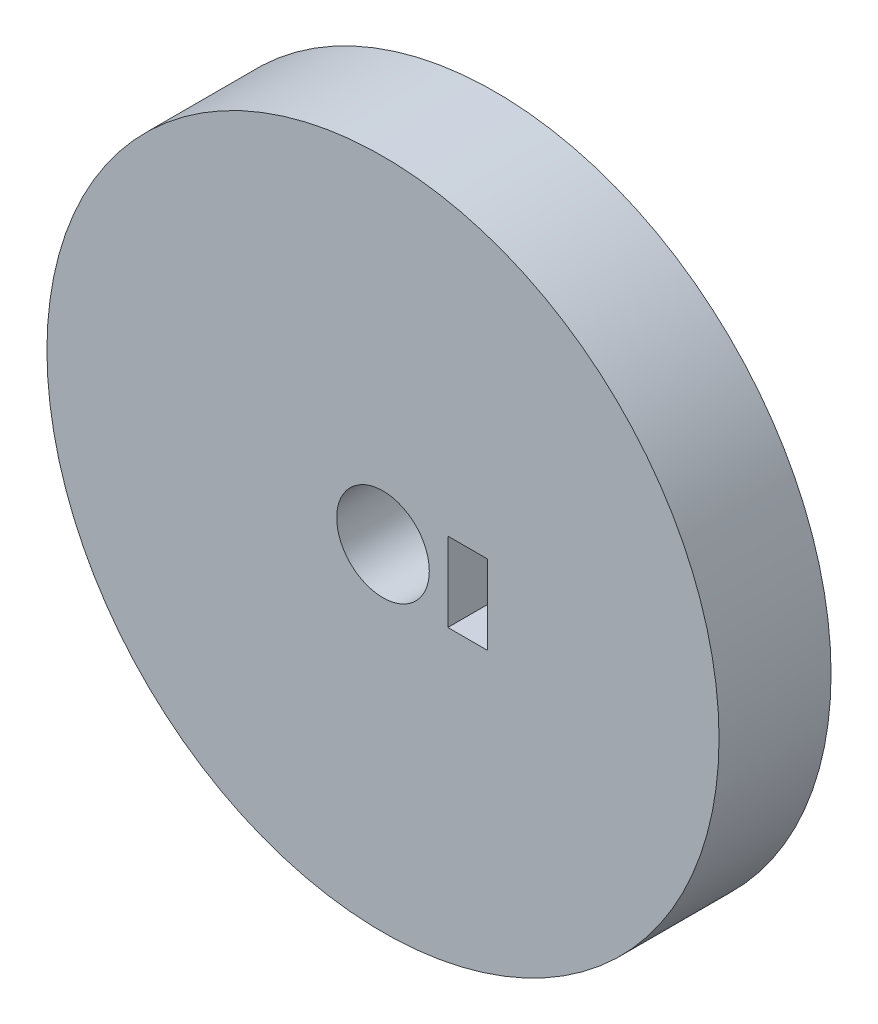
ISO-10303-21;
HEADER;
FILE_DESCRIPTION(('STEP AP214'),'2;1');
FILE_NAME('part.step','',(''),(''),'','','');
FILE_SCHEMA(('AUTOMOTIVE_DESIGN { 1 0 10303 214 1 1 1 1 }'));
ENDSEC;
DATA;
#1=APPLICATION_CONTEXT('core data for automotive mechanical design processes');
#2=APPLICATION_PROTOCOL_DEFINITION('international standard','automotive_design',2000,#1);
#3=PRODUCT_CONTEXT('',#1,'mechanical');
#4=PRODUCT('Part','Part','',(#3));
#5=PRODUCT_RELATED_PRODUCT_CATEGORY('part','',(#4));
#6=PRODUCT_DEFINITION_FORMATION('','',#4);
#7=PRODUCT_DEFINITION_CONTEXT('part definition',#1,'design');
#8=PRODUCT_DEFINITION('design','',#6,#7);
#9=PRODUCT_DEFINITION_SHAPE('','',#8);
#10=(LENGTH_UNIT() NAMED_UNIT(*) SI_UNIT(.MILLI.,.METRE.));
#11=(NAMED_UNIT(*) PLANE_ANGLE_UNIT() SI_UNIT($,.RADIAN.));
#12=(NAMED_UNIT(*) SI_UNIT($,.STERADIAN.) SOLID_ANGLE_UNIT());
#13=UNCERTAINTY_MEASURE_WITH_UNIT(LENGTH_MEASURE(1.E-05),#10,'distance_accuracy_value','');
#14=(GEOMETRIC_REPRESENTATION_CONTEXT(3) GLOBAL_UNCERTAINTY_ASSIGNED_CONTEXT((#13)) GLOBAL_UNIT_ASSIGNED_CONTEXT((#10,
#11,#12)) REPRESENTATION_CONTEXT('',''));
#15=CARTESIAN_POINT('',(0.,0.,0.));
#16=DIRECTION('',(0.,0.,1.));
#17=DIRECTION('',(1.,0.,0.));
#18=AXIS2_PLACEMENT_3D('',#15,#16,#17);
#19=CARTESIAN_POINT('',(0.,-7.07220049371049,15.));
#20=DIRECTION('',(0.,-1.,0.));
#21=DIRECTION('',(0.,0.,-1.));
#22=AXIS2_PLACEMENT_3D('',#19,#20,#21);
#23=PLANE('',#22);
#24=DIRECTION('',(-1.,0.,0.));
#25=VECTOR('',#24,1.);
#26=CARTESIAN_POINT('',(0.,-7.07220049371049,0.));
#27=LINE('',#26,#25);
#28=CARTESIAN_POINT('',(-71.3345035865023,-7.07220049371048,0.));
#29=VERTEX_POINT('',#28);
#30=CARTESIAN_POINT('',(-76.6345035865023,-7.07220049371049,0.));
#31=VERTEX_POINT('',#30);
#32=EDGE_CURVE('E111',#29,#31,#27,.T.);
#33=ORIENTED_EDGE('',*,*,#32,.F.);
#34=DIRECTION('',(0.,0.,-1.));
#35=VECTOR('',#34,1.);
#36=CARTESIAN_POINT('',(-71.3345035865023,-7.07220049371048,15.));
#37=LINE('',#36,#35);
#38=CARTESIAN_POINT('',(-71.3345035865023,-7.07220049371048,15.));
#39=VERTEX_POINT('',#38);
#40=EDGE_CURVE('E11',#39,#29,#37,.T.);
#41=ORIENTED_EDGE('',*,*,#40,.F.);
#42=DIRECTION('',(-1.,0.,0.));
#43=VECTOR('',#42,1.);
#44=CARTESIAN_POINT('',(0.,-7.07220049371049,15.));
#45=LINE('',#44,#43);
#46=CARTESIAN_POINT('',(-76.6345035865023,-7.07220049371049,15.));
#47=VERTEX_POINT('',#46);
#48=EDGE_CURVE('E91',#39,#47,#45,.T.);
#49=ORIENTED_EDGE('',*,*,#48,.T.);
#50=DIRECTION('',(0.,0.,-1.));
#51=VECTOR('',#50,1.);
#52=CARTESIAN_POINT('',(-76.6345035865023,-7.07220049371049,15.));
#53=LINE('',#52,#51);
#54=EDGE_CURVE('E52',#47,#31,#53,.T.);
#55=ORIENTED_EDGE('',*,*,#54,.T.);
#56=EDGE_LOOP('',(#33,#41,#49,#55));
#57=FACE_BOUND('',#56,.T.);
#58=ADVANCED_FACE('F35',(#57),#23,.T.);
#59=CARTESIAN_POINT('',(-71.3345035865023,4.669646717685E-13,15.));
#60=DIRECTION('',(1.,0.,0.));
#61=DIRECTION('',(0.,1.,0.));
#62=AXIS2_PLACEMENT_3D('',#59,#60,#61);
#63=PLANE('',#62);
#64=DIRECTION('',(0.,-1.,0.));
#65=VECTOR('',#64,1.);
#66=CARTESIAN_POINT('',(-71.3345035865023,4.669646717685E-13,0.));
#67=LINE('',#66,#65);
#68=CARTESIAN_POINT('',(-71.3345035865024,-17.6722004937109,0.));
#69=VERTEX_POINT('',#68);
#70=EDGE_CURVE('E96',#29,#69,#67,.T.);
#71=ORIENTED_EDGE('',*,*,#70,.T.);
#72=DIRECTION('',(0.,0.,-1.));
#73=VECTOR('',#72,1.);
#74=CARTESIAN_POINT('',(-71.3345035865024,-17.6722004937109,15.));
#75=LINE('',#74,#73);
#76=CARTESIAN_POINT('',(-71.3345035865024,-17.6722004937109,15.));
#77=VERTEX_POINT('',#76);
#78=EDGE_CURVE('E44',#77,#69,#75,.T.);
#79=ORIENTED_EDGE('',*,*,#78,.F.);
#80=DIRECTION('',(0.,-1.,0.));
#81=VECTOR('',#80,1.);
#82=CARTESIAN_POINT('',(-71.3345035865023,4.669646717685E-13,15.));
#83=LINE('',#82,#81);
#84=EDGE_CURVE('E86',#39,#77,#83,.T.);
#85=ORIENTED_EDGE('',*,*,#84,.F.);
#86=ORIENTED_EDGE('',*,*,#40,.T.);
#87=EDGE_LOOP('',(#71,#79,#85,#86));
#88=FACE_BOUND('',#87,.T.);
#89=ADVANCED_FACE('F94',(#88),#63,.F.);
#90=CARTESIAN_POINT('',(0.,-17.6722004937109,15.));
#91=DIRECTION('',(0.,-1.,0.));
#92=DIRECTION('',(0.,0.,-1.));
#93=AXIS2_PLACEMENT_3D('',#90,#91,#92);
#94=PLANE('',#93);
#95=DIRECTION('',(-1.,0.,0.));
#96=VECTOR('',#95,1.);
#97=CARTESIAN_POINT('',(0.,-17.6722004937109,0.));
#98=LINE('',#97,#96);
#99=CARTESIAN_POINT('',(-76.6345035865023,-17.6722004937109,0.));
#100=VERTEX_POINT('',#99);
#101=EDGE_CURVE('E108',#69,#100,#98,.T.);
#102=ORIENTED_EDGE('',*,*,#101,.T.);
#103=DIRECTION('',(0.,0.,-1.));
#104=VECTOR('',#103,1.);
#105=CARTESIAN_POINT('',(-76.6345035865023,-17.6722004937109,15.));
#106=LINE('',#105,#104);
#107=CARTESIAN_POINT('',(-76.6345035865023,-17.6722004937109,15.));
#108=VERTEX_POINT('',#107);
#109=EDGE_CURVE('E66',#108,#100,#106,.T.);
#110=ORIENTED_EDGE('',*,*,#109,.F.);
#111=DIRECTION('',(-1.,0.,0.));
#112=VECTOR('',#111,1.);
#113=CARTESIAN_POINT('',(0.,-17.6722004937109,15.));
#114=LINE('',#113,#112);
#115=EDGE_CURVE('E78',#77,#108,#114,.T.);
#116=ORIENTED_EDGE('',*,*,#115,.F.);
#117=ORIENTED_EDGE('',*,*,#78,.T.);
#118=EDGE_LOOP('',(#102,#110,#116,#117));
#119=FACE_BOUND('',#118,.T.);
#120=ADVANCED_FACE('F80',(#119),#94,.F.);
#121=CARTESIAN_POINT('',(-76.6345035865023,0.,15.));
#122=DIRECTION('',(1.,0.,0.));
#123=DIRECTION('',(0.,0.,-1.));
#124=AXIS2_PLACEMENT_3D('',#121,#122,#123);
#125=PLANE('',#124);
#126=DIRECTION('',(0.,-1.,0.));
#127=VECTOR('',#126,1.);
#128=CARTESIAN_POINT('',(-76.6345035865023,0.,0.));
#129=LINE('',#128,#127);
#130=EDGE_CURVE('E105',#31,#100,#129,.T.);
#131=ORIENTED_EDGE('',*,*,#130,.F.);
#132=ORIENTED_EDGE('',*,*,#54,.F.);
#133=DIRECTION('',(0.,-1.,0.));
#134=VECTOR('',#133,1.);
#135=CARTESIAN_POINT('',(-76.6345035865023,0.,15.));
#136=LINE('',#135,#134);
#137=EDGE_CURVE('E85',#47,#108,#136,.T.);
#138=ORIENTED_EDGE('',*,*,#137,.T.);
#139=ORIENTED_EDGE('',*,*,#109,.T.);
#140=EDGE_LOOP('',(#131,#132,#138,#139));
#141=FACE_BOUND('',#140,.T.);
#142=ADVANCED_FACE('F145',(#141),#125,.T.);
#143=CARTESIAN_POINT('',(-85.3166325712119,-12.3722004937105,15.));
#144=DIRECTION('',(0.,0.,-1.));
#145=DIRECTION('',(-1.,0.,0.));
#146=AXIS2_PLACEMENT_3D('',#143,#144,#145);
#147=CYLINDRICAL_SURFACE('',#146,6.2);
#148=CARTESIAN_POINT('',(-85.3166325712119,-12.3722004937105,15.));
#149=DIRECTION('',(0.,0.,1.));
#150=DIRECTION('',(1.,0.,0.));
#151=AXIS2_PLACEMENT_3D('',#148,#149,#150);
#152=CIRCLE('',#151,6.2);
#153=CARTESIAN_POINT('',(-79.1166325712119,-12.3722004937105,15.));
#154=VERTEX_POINT('',#153);
#155=EDGE_CURVE('E104',#154,#154,#152,.T.);
#156=ORIENTED_EDGE('',*,*,#155,.T.);
#157=EDGE_LOOP('',(#156));
#158=FACE_BOUND('',#157,.T.);
#159=CARTESIAN_POINT('',(-85.3166325712119,-12.3722004937105,0.));
#160=DIRECTION('',(0.,0.,1.));
#161=DIRECTION('',(1.,0.,0.));
#162=AXIS2_PLACEMENT_3D('',#159,#160,#161);
#163=CIRCLE('',#162,6.2);
#164=CARTESIAN_POINT('',(-79.1166325712119,-12.3722004937105,0.));
#165=VERTEX_POINT('',#164);
#166=EDGE_CURVE('E113',#165,#165,#163,.T.);
#167=ORIENTED_EDGE('',*,*,#166,.F.);
#168=EDGE_LOOP('',(#167));
#169=FACE_BOUND('',#168,.T.);
#170=ADVANCED_FACE('F37',(#158,#169),#147,.F.);
#171=CARTESIAN_POINT('',(-85.3166325712119,-12.3722004937105,15.));
#172=DIRECTION('',(0.,0.,-1.));
#173=DIRECTION('',(-1.,0.,0.));
#174=AXIS2_PLACEMENT_3D('',#171,#172,#173);
#175=CYLINDRICAL_SURFACE('',#174,45.);
#176=CARTESIAN_POINT('',(-85.3166325712119,-12.3722004937105,15.));
#177=DIRECTION('',(0.,0.,1.));
#178=DIRECTION('',(1.,0.,0.));
#179=AXIS2_PLACEMENT_3D('',#176,#177,#178);
#180=CIRCLE('',#179,45.);
#181=CARTESIAN_POINT('',(-40.3166325712119,-12.3722004937105,15.));
#182=VERTEX_POINT('',#181);
#183=EDGE_CURVE('E100',#182,#182,#180,.T.);
#184=ORIENTED_EDGE('',*,*,#183,.F.);
#185=EDGE_LOOP('',(#184));
#186=FACE_BOUND('',#185,.T.);
#187=CARTESIAN_POINT('',(-85.3166325712119,-12.3722004937105,0.));
#188=DIRECTION('',(0.,0.,1.));
#189=DIRECTION('',(1.,0.,0.));
#190=AXIS2_PLACEMENT_3D('',#187,#188,#189);
#191=CIRCLE('',#190,45.);
#192=CARTESIAN_POINT('',(-40.3166325712119,-12.3722004937105,0.));
#193=VERTEX_POINT('',#192);
#194=EDGE_CURVE('E101',#193,#193,#191,.T.);
#195=ORIENTED_EDGE('',*,*,#194,.T.);
#196=EDGE_LOOP('',(#195));
#197=FACE_BOUND('',#196,.T.);
#198=ADVANCED_FACE('F127',(#186,#197),#175,.T.);
#199=CARTESIAN_POINT('',(0.,0.,15.));
#200=DIRECTION('',(0.,0.,1.));
#201=DIRECTION('',(1.,0.,0.));
#202=AXIS2_PLACEMENT_3D('',#199,#200,#201);
#203=PLANE('',#202);
#204=ORIENTED_EDGE('',*,*,#155,.F.);
#205=EDGE_LOOP('',(#204));
#206=FACE_BOUND('',#205,.T.);
#207=ORIENTED_EDGE('',*,*,#48,.F.);
#208=ORIENTED_EDGE('',*,*,#84,.T.);
#209=ORIENTED_EDGE('',*,*,#115,.T.);
#210=ORIENTED_EDGE('',*,*,#137,.F.);
#211=EDGE_LOOP('',(#207,#208,#209,#210));
#212=FACE_BOUND('',#211,.T.);
#213=ORIENTED_EDGE('',*,*,#183,.T.);
#214=EDGE_LOOP('',(#213));
#215=FACE_BOUND('',#214,.T.);
#216=ADVANCED_FACE('F89',(#206,#212,#215),#203,.T.);
#217=CARTESIAN_POINT('',(0.,0.,0.));
#218=DIRECTION('',(0.,0.,1.));
#219=DIRECTION('',(1.,0.,0.));
#220=AXIS2_PLACEMENT_3D('',#217,#218,#219);
#221=PLANE('',#220);
#222=ORIENTED_EDGE('',*,*,#166,.T.);
#223=EDGE_LOOP('',(#222));
#224=FACE_BOUND('',#223,.T.);
#225=ORIENTED_EDGE('',*,*,#32,.T.);
#226=ORIENTED_EDGE('',*,*,#130,.T.);
#227=ORIENTED_EDGE('',*,*,#101,.F.);
#228=ORIENTED_EDGE('',*,*,#70,.F.);
#229=EDGE_LOOP('',(#225,#226,#227,#228));
#230=FACE_BOUND('',#229,.T.);
#231=ORIENTED_EDGE('',*,*,#194,.F.);
#232=EDGE_LOOP('',(#231));
#233=FACE_BOUND('',#232,.T.);
#234=ADVANCED_FACE('F126',(#224,#230,#233),#221,.F.);
#235=CLOSED_SHELL('',(#58,#89,#120,#142,#170,#198,#216,#234));
#236=MANIFOLD_SOLID_BREP('B2',#235);
#237=ADVANCED_BREP_SHAPE_REPRESENTATION('',(#18,#236),#14);
#238=SHAPE_DEFINITION_REPRESENTATION(#9,#237);
ENDSEC;
END-ISO-10303-21;
